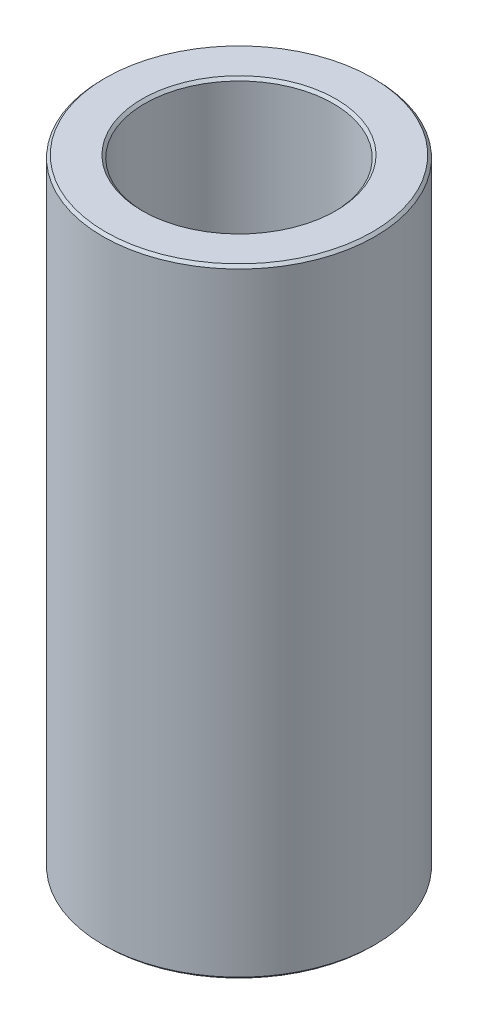
ISO-10303-21;
HEADER;
FILE_DESCRIPTION(('STEP AP214'),'2;1');
FILE_NAME('part.step','',(''),(''),'','','');
FILE_SCHEMA(('AUTOMOTIVE_DESIGN { 1 0 10303 214 1 1 1 1 }'));
ENDSEC;
DATA;
#1=APPLICATION_CONTEXT('core data for automotive mechanical design processes');
#2=APPLICATION_PROTOCOL_DEFINITION('international standard','automotive_design',2000,#1);
#3=PRODUCT_CONTEXT('',#1,'mechanical');
#4=PRODUCT('Part','Part','',(#3));
#5=PRODUCT_RELATED_PRODUCT_CATEGORY('part','',(#4));
#6=PRODUCT_DEFINITION_FORMATION('','',#4);
#7=PRODUCT_DEFINITION_CONTEXT('part definition',#1,'design');
#8=PRODUCT_DEFINITION('design','',#6,#7);
#9=PRODUCT_DEFINITION_SHAPE('','',#8);
#10=(LENGTH_UNIT() NAMED_UNIT(*) SI_UNIT(.MILLI.,.METRE.));
#11=(NAMED_UNIT(*) PLANE_ANGLE_UNIT() SI_UNIT($,.RADIAN.));
#12=(NAMED_UNIT(*) SI_UNIT($,.STERADIAN.) SOLID_ANGLE_UNIT());
#13=UNCERTAINTY_MEASURE_WITH_UNIT(LENGTH_MEASURE(1.E-05),#10,'distance_accuracy_value','');
#14=(GEOMETRIC_REPRESENTATION_CONTEXT(3) GLOBAL_UNCERTAINTY_ASSIGNED_CONTEXT((#13)) GLOBAL_UNIT_ASSIGNED_CONTEXT((#10,
#11,#12)) REPRESENTATION_CONTEXT('',''));
#15=CARTESIAN_POINT('',(0.,0.,0.));
#16=DIRECTION('',(0.,0.,1.));
#17=DIRECTION('',(1.,0.,0.));
#18=AXIS2_PLACEMENT_3D('',#15,#16,#17);
#19=CARTESIAN_POINT('',(0.,159.03846639534,0.));
#20=DIRECTION('',(0.,-1.,0.));
#21=DIRECTION('',(0.,0.,-1.));
#22=AXIS2_PLACEMENT_3D('',#19,#20,#21);
#23=CYLINDRICAL_SURFACE('',#22,35.);
#24=CARTESIAN_POINT('',(0.,0.68585868900789,0.));
#25=DIRECTION('',(0.,1.,0.));
#26=DIRECTION('',(0.,0.,1.));
#27=AXIS2_PLACEMENT_3D('',#24,#25,#26);
#28=CIRCLE('',#27,35.);
#29=CARTESIAN_POINT('',(0.,0.68585868900789,35.));
#30=VERTEX_POINT('',#29);
#31=EDGE_CURVE('E10',#30,#30,#28,.T.);
#32=ORIENTED_EDGE('',*,*,#31,.T.);
#33=EDGE_LOOP('',(#32));
#34=FACE_BOUND('',#33,.T.);
#35=CARTESIAN_POINT('',(0.,158.352607706332,0.));
#36=DIRECTION('',(0.,1.,0.));
#37=DIRECTION('',(0.,0.,1.));
#38=AXIS2_PLACEMENT_3D('',#35,#36,#37);
#39=CIRCLE('',#38,35.);
#40=CARTESIAN_POINT('',(0.,158.352607706332,35.));
#41=VERTEX_POINT('',#40);
#42=EDGE_CURVE('E50',#41,#41,#39,.F.);
#43=ORIENTED_EDGE('',*,*,#42,.T.);
#44=EDGE_LOOP('',(#43));
#45=FACE_BOUND('',#44,.T.);
#46=ADVANCED_FACE('F39',(#34,#45),#23,.T.);
#47=CARTESIAN_POINT('',(0.,159.03846639534,0.));
#48=DIRECTION('',(0.,1.,0.));
#49=DIRECTION('',(0.,0.,1.));
#50=AXIS2_PLACEMENT_3D('',#47,#48,#49);
#51=PLANE('',#50);
#52=CARTESIAN_POINT('',(0.,159.03846639534,0.));
#53=DIRECTION('',(0.,1.,0.));
#54=DIRECTION('',(0.,0.,1.));
#55=AXIS2_PLACEMENT_3D('',#52,#53,#54);
#56=CIRCLE('',#55,24.9197782604176);
#57=CARTESIAN_POINT('',(0.,159.03846639534,24.9197782604176));
#58=VERTEX_POINT('',#57);
#59=EDGE_CURVE('E58',#58,#58,#56,.F.);
#60=ORIENTED_EDGE('',*,*,#59,.T.);
#61=EDGE_LOOP('',(#60));
#62=FACE_BOUND('',#61,.T.);
#63=CARTESIAN_POINT('',(0.,159.03846639534,0.));
#64=DIRECTION('',(0.,1.,0.));
#65=DIRECTION('',(0.,0.,1.));
#66=AXIS2_PLACEMENT_3D('',#63,#64,#65);
#67=CIRCLE('',#66,34.3141413109921);
#68=CARTESIAN_POINT('',(0.,159.03846639534,34.3141413109921));
#69=VERTEX_POINT('',#68);
#70=EDGE_CURVE('E61',#69,#69,#67,.T.);
#71=ORIENTED_EDGE('',*,*,#70,.T.);
#72=EDGE_LOOP('',(#71));
#73=FACE_BOUND('',#72,.T.);
#74=ADVANCED_FACE('F88',(#62,#73),#51,.T.);
#75=CARTESIAN_POINT('',(0.,0.,0.));
#76=DIRECTION('',(0.,1.,0.));
#77=DIRECTION('',(0.,0.,1.));
#78=AXIS2_PLACEMENT_3D('',#75,#76,#77);
#79=PLANE('',#78);
#80=CARTESIAN_POINT('',(0.,0.,0.));
#81=DIRECTION('',(0.,1.,0.));
#82=DIRECTION('',(0.,0.,1.));
#83=AXIS2_PLACEMENT_3D('',#80,#81,#82);
#84=CIRCLE('',#83,24.9197782604177);
#85=CARTESIAN_POINT('',(0.,0.,24.9197782604177));
#86=VERTEX_POINT('',#85);
#87=EDGE_CURVE('E51',#86,#86,#84,.T.);
#88=ORIENTED_EDGE('',*,*,#87,.T.);
#89=EDGE_LOOP('',(#88));
#90=FACE_BOUND('',#89,.T.);
#91=CARTESIAN_POINT('',(0.,0.,0.));
#92=DIRECTION('',(0.,1.,0.));
#93=DIRECTION('',(0.,0.,1.));
#94=AXIS2_PLACEMENT_3D('',#91,#92,#93);
#95=CIRCLE('',#94,34.3141413109921);
#96=CARTESIAN_POINT('',(0.,0.,34.3141413109921));
#97=VERTEX_POINT('',#96);
#98=EDGE_CURVE('E54',#97,#97,#95,.F.);
#99=ORIENTED_EDGE('',*,*,#98,.T.);
#100=EDGE_LOOP('',(#99));
#101=FACE_BOUND('',#100,.T.);
#102=ADVANCED_FACE('F83',(#90,#101),#79,.F.);
#103=CARTESIAN_POINT('',(0.,159.03846639534,0.));
#104=DIRECTION('',(0.,-1.,0.));
#105=DIRECTION('',(0.,0.,-1.));
#106=AXIS2_PLACEMENT_3D('',#103,#104,#105);
#107=CYLINDRICAL_SURFACE('',#106,24.2339195714098);
#108=CARTESIAN_POINT('',(0.,158.352607706332,0.));
#109=DIRECTION('',(0.,1.,0.));
#110=DIRECTION('',(0.,0.,1.));
#111=AXIS2_PLACEMENT_3D('',#108,#109,#110);
#112=CIRCLE('',#111,24.2339195714098);
#113=CARTESIAN_POINT('',(0.,158.352607706332,24.2339195714098));
#114=VERTEX_POINT('',#113);
#115=EDGE_CURVE('E67',#114,#114,#112,.T.);
#116=ORIENTED_EDGE('',*,*,#115,.T.);
#117=EDGE_LOOP('',(#116));
#118=FACE_BOUND('',#117,.T.);
#119=CARTESIAN_POINT('',(0.,0.685858689007945,0.));
#120=DIRECTION('',(0.,1.,0.));
#121=DIRECTION('',(0.,0.,1.));
#122=AXIS2_PLACEMENT_3D('',#119,#120,#121);
#123=CIRCLE('',#122,24.2339195714098);
#124=CARTESIAN_POINT('',(0.,0.685858689007945,24.2339195714098));
#125=VERTEX_POINT('',#124);
#126=EDGE_CURVE('E69',#125,#125,#123,.F.);
#127=ORIENTED_EDGE('',*,*,#126,.T.);
#128=EDGE_LOOP('',(#127));
#129=FACE_BOUND('',#128,.T.);
#130=ADVANCED_FACE('F71',(#118,#129),#107,.F.);
#131=CARTESIAN_POINT('',(0.,158.352607706332,0.));
#132=DIRECTION('',(0.,1.,0.));
#133=DIRECTION('',(0.,0.,1.));
#134=AXIS2_PLACEMENT_3D('',#131,#132,#133);
#135=CONICAL_SURFACE('',#134,24.2339195714098,0.785398163397441);
#136=ORIENTED_EDGE('',*,*,#59,.F.);
#137=EDGE_LOOP('',(#136));
#138=FACE_BOUND('',#137,.T.);
#139=ORIENTED_EDGE('',*,*,#115,.F.);
#140=EDGE_LOOP('',(#139));
#141=FACE_BOUND('',#140,.T.);
#142=ADVANCED_FACE('F77',(#138,#141),#135,.F.);
#143=CARTESIAN_POINT('',(0.,0.,0.));
#144=DIRECTION('',(0.,-1.,0.));
#145=DIRECTION('',(0.,0.,-1.));
#146=AXIS2_PLACEMENT_3D('',#143,#144,#145);
#147=CONICAL_SURFACE('',#146,24.9197782604177,0.785398163397451);
#148=ORIENTED_EDGE('',*,*,#126,.F.);
#149=EDGE_LOOP('',(#148));
#150=FACE_BOUND('',#149,.T.);
#151=ORIENTED_EDGE('',*,*,#87,.F.);
#152=EDGE_LOOP('',(#151));
#153=FACE_BOUND('',#152,.T.);
#154=ADVANCED_FACE('F73',(#150,#153),#147,.F.);
#155=CARTESIAN_POINT('',(0.,0.68585868900789,0.));
#156=DIRECTION('',(0.,1.,0.));
#157=DIRECTION('',(0.,0.,1.));
#158=AXIS2_PLACEMENT_3D('',#155,#156,#157);
#159=CONICAL_SURFACE('',#158,35.,0.785398163397453);
#160=ORIENTED_EDGE('',*,*,#98,.F.);
#161=EDGE_LOOP('',(#160));
#162=FACE_BOUND('',#161,.T.);
#163=ORIENTED_EDGE('',*,*,#31,.F.);
#164=EDGE_LOOP('',(#163));
#165=FACE_BOUND('',#164,.T.);
#166=ADVANCED_FACE('F76',(#162,#165),#159,.T.);
#167=CARTESIAN_POINT('',(0.,159.03846639534,0.));
#168=DIRECTION('',(0.,-1.,0.));
#169=DIRECTION('',(0.,0.,-1.));
#170=AXIS2_PLACEMENT_3D('',#167,#168,#169);
#171=CONICAL_SURFACE('',#170,34.3141413109921,0.785398163397453);
#172=ORIENTED_EDGE('',*,*,#42,.F.);
#173=EDGE_LOOP('',(#172));
#174=FACE_BOUND('',#173,.T.);
#175=ORIENTED_EDGE('',*,*,#70,.F.);
#176=EDGE_LOOP('',(#175));
#177=FACE_BOUND('',#176,.T.);
#178=ADVANCED_FACE('F45',(#174,#177),#171,.T.);
#179=CLOSED_SHELL('',(#46,#74,#102,#130,#142,#154,#166,#178));
#180=MANIFOLD_SOLID_BREP('B2',#179);
#181=ADVANCED_BREP_SHAPE_REPRESENTATION('',(#18,#180),#14);
#182=SHAPE_DEFINITION_REPRESENTATION(#9,#181);
ENDSEC;
END-ISO-10303-21;
